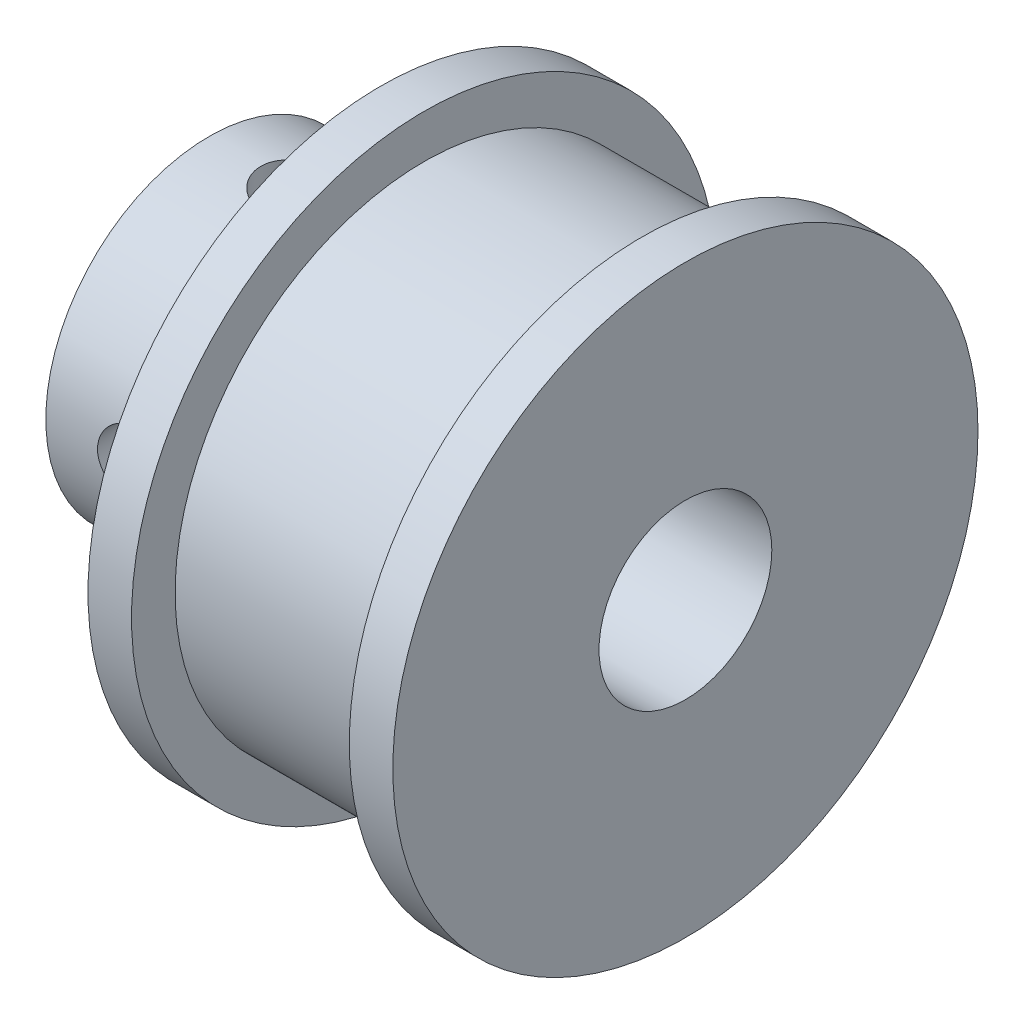
ISO-10303-21;
HEADER;
FILE_DESCRIPTION(('STEP AP214'),'2;1');
FILE_NAME('part.step','',(''),(''),'','','');
FILE_SCHEMA(('AUTOMOTIVE_DESIGN { 1 0 10303 214 1 1 1 1 }'));
ENDSEC;
DATA;
#1=APPLICATION_CONTEXT('core data for automotive mechanical design processes');
#2=APPLICATION_PROTOCOL_DEFINITION('international standard','automotive_design',2000,#1);
#3=PRODUCT_CONTEXT('',#1,'mechanical');
#4=PRODUCT('Part','Part','',(#3));
#5=PRODUCT_RELATED_PRODUCT_CATEGORY('part','',(#4));
#6=PRODUCT_DEFINITION_FORMATION('','',#4);
#7=PRODUCT_DEFINITION_CONTEXT('part definition',#1,'design');
#8=PRODUCT_DEFINITION('design','',#6,#7);
#9=PRODUCT_DEFINITION_SHAPE('','',#8);
#10=(LENGTH_UNIT() NAMED_UNIT(*) SI_UNIT(.MILLI.,.METRE.));
#11=(NAMED_UNIT(*) PLANE_ANGLE_UNIT() SI_UNIT($,.RADIAN.));
#12=(NAMED_UNIT(*) SI_UNIT($,.STERADIAN.) SOLID_ANGLE_UNIT());
#13=UNCERTAINTY_MEASURE_WITH_UNIT(LENGTH_MEASURE(1.E-05),#10,'distance_accuracy_value','');
#14=(GEOMETRIC_REPRESENTATION_CONTEXT(3) GLOBAL_UNCERTAINTY_ASSIGNED_CONTEXT((#13)) GLOBAL_UNIT_ASSIGNED_CONTEXT((#10,
#11,#12)) REPRESENTATION_CONTEXT('',''));
#15=CARTESIAN_POINT('',(0.,0.,0.));
#16=DIRECTION('',(0.,0.,1.));
#17=DIRECTION('',(1.,0.,0.));
#18=AXIS2_PLACEMENT_3D('',#15,#16,#17);
#19=CARTESIAN_POINT('',(0.,0.,0.));
#20=DIRECTION('',(1.,0.,0.));
#21=DIRECTION('',(0.,0.,-1.));
#22=AXIS2_PLACEMENT_3D('',#19,#20,#21);
#23=CYLINDRICAL_SURFACE('',#22,3.175);
#24=CARTESIAN_POINT('',(1.90000000000001,0.,3.175));
#25=CARTESIAN_POINT('',(1.9000068627745,0.0672847316330924,3.17499501338285));
#26=CARTESIAN_POINT('',(1.90546359305505,0.1346703640608,3.17283650663751));
#27=CARTESIAN_POINT('',(1.92710352845715,0.267542369031608,3.16441250521978));
#28=CARTESIAN_POINT('',(1.94331412522152,0.333023444641002,3.15813652319774));
#29=CARTESIAN_POINT('',(1.9857829777871,0.459957962416117,3.14215557601542));
#30=CARTESIAN_POINT('',(2.01200951215206,0.521423409993961,3.1324614438269));
#31=CARTESIAN_POINT('',(2.07364090841074,0.63903164640658,3.11060223187218));
#32=CARTESIAN_POINT('',(2.1090429677438,0.695176053354679,3.09843790684371));
#33=CARTESIAN_POINT('',(2.1897376821198,0.803199302091193,3.07224897424454));
#34=CARTESIAN_POINT('',(2.23538195508738,0.854801684849634,3.05816785515032));
#35=CARTESIAN_POINT('',(2.33452307874792,0.949851027050096,3.029995134943));
#36=CARTESIAN_POINT('',(2.38802352829044,0.993294227940917,3.01590353198658));
#37=CARTESIAN_POINT('',(2.5041424024409,1.07262244667806,2.98863572549245));
#38=CARTESIAN_POINT('',(2.56705314443539,1.10810421355732,2.97552454842956));
#39=CARTESIAN_POINT('',(2.698544027874,1.16785949338492,2.95258553832485));
#40=CARTESIAN_POINT('',(2.7671215628923,1.19213812572271,2.94275620617845));
#41=CARTESIAN_POINT('',(2.90482457540723,1.22768807019404,2.92809906106053));
#42=CARTESIAN_POINT('',(2.97379138336201,1.2394876533875,2.92306908743274));
#43=CARTESIAN_POINT('',(3.11289538673181,1.25139521634013,2.91799267608066));
#44=CARTESIAN_POINT('',(3.18303201481214,1.2515087076257,2.91794388907308));
#45=CARTESIAN_POINT('',(3.31747264612622,1.24044215294952,2.92266241514435));
#46=CARTESIAN_POINT('',(3.38185243388379,1.2300187638983,2.9271070555664));
#47=CARTESIAN_POINT('',(3.50786207063953,1.19943319152663,2.93977143360488));
#48=CARTESIAN_POINT('',(3.56949145415953,1.17926936651212,2.94799180758784));
#49=CARTESIAN_POINT('',(3.68970949878321,1.12939589279822,2.9674595549287));
#50=CARTESIAN_POINT('',(3.74821240698525,1.09950293840843,2.97876432051874));
#51=CARTESIAN_POINT('',(3.85958183190654,1.03114819003906,3.00311044973729));
#52=CARTESIAN_POINT('',(3.91244626347388,0.992683242204219,3.01615245182717));
#53=CARTESIAN_POINT('',(4.01519223792226,0.90489847311778,3.04369028436772));
#54=CARTESIAN_POINT('',(4.06455620057866,0.854982538626526,3.05822195069566));
#55=CARTESIAN_POINT('',(4.15437521291328,0.747422600693478,3.08627133748347));
#56=CARTESIAN_POINT('',(4.19482859712145,0.68977715576794,3.09978886808114));
#57=CARTESIAN_POINT('',(4.26632885010501,0.566964697663757,3.12460676760529));
#58=CARTESIAN_POINT('',(4.29718676961865,0.501677729871156,3.13586122258918));
#59=CARTESIAN_POINT('',(4.34730502697112,0.366284378650628,3.15453954285868));
#60=CARTESIAN_POINT('',(4.36657106552982,0.296180383098904,3.16196529078971));
#61=CARTESIAN_POINT('',(4.39192526522841,0.15748598181363,3.17180954080983));
#62=CARTESIAN_POINT('',(4.398709348115,0.08904145870925,3.174492125026));
#63=CARTESIAN_POINT('',(4.4009546291958,-0.0480536320474739,3.17537559014029));
#64=CARTESIAN_POINT('',(4.39641864995898,-0.116704144074904,3.17357758823769));
#65=CARTESIAN_POINT('',(4.3766688987383,-0.249146112043378,3.1658751934269));
#66=CARTESIAN_POINT('',(4.36192521803439,-0.313019327348947,3.16015168509209));
#67=CARTESIAN_POINT('',(4.32281288402532,-0.437330047990826,3.14535985768854));
#68=CARTESIAN_POINT('',(4.29844298886303,-0.497767108885045,3.1362911070673));
#69=CARTESIAN_POINT('',(4.23997777394203,-0.615550644692232,3.11535083253378));
#70=CARTESIAN_POINT('',(4.20560984846939,-0.672747743207499,3.10340262881889));
#71=CARTESIAN_POINT('',(4.12842792642724,-0.780761917259374,3.07800576012949));
#72=CARTESIAN_POINT('',(4.08561060602606,-0.831576469108153,3.06455650557748));
#73=CARTESIAN_POINT('',(3.98952965745297,-0.928791348114859,3.0365593899859));
#74=CARTESIAN_POINT('',(3.93577293586608,-0.974701227513619,3.02199629492691));
#75=CARTESIAN_POINT('',(3.82105274982168,-1.05696284943212,2.99421855171024));
#76=CARTESIAN_POINT('',(3.76008825217309,-1.09331321924023,2.98100409737911));
#77=CARTESIAN_POINT('',(3.63187774635261,-1.15559997165607,2.95742074651155));
#78=CARTESIAN_POINT('',(3.56458459593159,-1.18144907129597,2.9470759174758));
#79=CARTESIAN_POINT('',(3.4260725952737,-1.2212562072246,2.93080697789355));
#80=CARTESIAN_POINT('',(3.35485655568267,-1.23522264211379,2.92487974538276));
#81=CARTESIAN_POINT('',(3.21589405502895,-1.25007804085777,2.91855940228496));
#82=CARTESIAN_POINT('',(3.1482538653394,-1.25181430561831,2.91780781401761));
#83=CARTESIAN_POINT('',(3.01369577979596,-1.24437120429059,2.92098982763324));
#84=CARTESIAN_POINT('',(2.94677779981834,-1.23519312367105,2.92492287776943));
#85=CARTESIAN_POINT('',(2.81810207173594,-1.20686591196944,2.93671925445626));
#86=CARTESIAN_POINT('',(2.75624498467543,-1.18809939057282,2.9444313340829));
#87=CARTESIAN_POINT('',(2.63652982106708,-1.14148049607648,2.96281485611587));
#88=CARTESIAN_POINT('',(2.57867280512971,-1.1136257243581,2.97348707966731));
#89=CARTESIAN_POINT('',(2.4650674647447,-1.04781462002773,2.99733186522452));
#90=CARTESIAN_POINT('',(2.40961923756217,-1.00937948877753,3.01061106475901));
#91=CARTESIAN_POINT('',(2.30568987821778,-0.924206507043676,3.0378387527675));
#92=CARTESIAN_POINT('',(2.25721118976831,-0.877465757163235,3.05178747371865));
#93=CARTESIAN_POINT('',(2.16551587816836,-0.773553196077986,3.07982295515274));
#94=CARTESIAN_POINT('',(2.12281309958007,-0.715913819660185,3.09386447942524));
#95=CARTESIAN_POINT('',(2.04769454049986,-0.5937664037964,3.11960779538581));
#96=CARTESIAN_POINT('',(2.01528012935281,-0.529257451559142,3.13130927554577));
#97=CARTESIAN_POINT('',(1.96417540099936,-0.400855491445671,3.15020502613284));
#98=CARTESIAN_POINT('',(1.94455266817755,-0.337376283301317,3.15769788512325));
#99=CARTESIAN_POINT('',(1.91563614784328,-0.207895662632507,3.16884766902594));
#100=CARTESIAN_POINT('',(1.90631397142025,-0.141901703524203,3.17251513536217));
#101=CARTESIAN_POINT('',(1.90076135384054,-0.0504531001608372,3.17470085654944));
#102=CARTESIAN_POINT('',(1.8999974262687,-0.0252336457199433,3.17500187012012));
#103=CARTESIAN_POINT('',(1.90000000000001,0.,3.175));
#104=B_SPLINE_CURVE_WITH_KNOTS('',3,(#24,#25,#26,#27,#28,#29,#30,#31,#32,#33,#34,#35,#36,#37,
#38,#39,#40,#41,#42,#43,#44,#45,#46,#47,#48,#49,#50,#51,#52,#53,#54,#55,#56,#57,#58,#59,#60,#61,
#62,#63,#64,#65,#66,#67,#68,#69,#70,#71,#72,#73,#74,#75,#76,#77,#78,#79,#80,#81,#82,#83,#84,#85,
#86,#87,#88,#89,#90,#91,#92,#93,#94,#95,#96,#97,#98,#99,#100,#101,#102,#103),.UNSPECIFIED.,.T.,
.F.,(4,2,2,2,2,2,2,2,2,2,2,2,2,2,2,2,2,2,2,2,2,2,2,2,2,2,2,2,2,2,2,2,2,2,2,2,2,2,2,4),(0.,
0.201779437744548,0.404074820308127,0.605734757050763,0.807333171478417,1.01735976436243,
1.2274828705813,1.44660259463333,1.66562209023744,1.87494520835713,2.08416960269575,
2.27936669865592,2.47459670544107,2.67374147234743,2.87295963102294,3.08705517744558,
3.30119070642572,3.51930901537433,3.73731996902137,3.94275765182502,4.14814411546712,
4.34465147529728,4.54118419440118,4.7436789821994,4.94625358697288,5.1617892735487,
5.37735589340512,5.59467927329235,5.81184892233299,6.01381057507249,6.21574844354767,
6.41019345194811,6.60468982086286,6.81009090996547,7.01556384361703,7.2337987698656,
7.45206273023339,7.65177261299093,7.85093070050895,7.92660360165657),.UNSPECIFIED.);
#105=CARTESIAN_POINT('',(1.90000000000001,0.,3.175));
#106=VERTEX_POINT('',#105);
#107=EDGE_CURVE('E624',#106,#106,#104,.T.);
#108=ORIENTED_EDGE('',*,*,#107,.F.);
#109=EDGE_LOOP('',(#108));
#110=FACE_BOUND('',#109,.T.);
#111=CARTESIAN_POINT('',(3.15,2.91858270398493,-1.25));
#112=CARTESIAN_POINT('',(3.21705876770274,2.91858919552523,-1.24999286391997));
#113=CARTESIAN_POINT('',(3.28421776991305,2.92092645038722,-1.24457161253238));
#114=CARTESIAN_POINT('',(3.41661509708975,2.92998517442319,-1.2230858011541));
#115=CARTESIAN_POINT('',(3.48184795863823,2.93671805691524,-1.20699353198018));
#116=CARTESIAN_POINT('',(3.60825570633315,2.95367783504784,-1.16486992778129));
#117=CARTESIAN_POINT('',(3.66944461339327,2.96389181028401,-1.13887530486567));
#118=CARTESIAN_POINT('',(3.78657755098346,2.98664490940932,-1.07779173231123));
#119=CARTESIAN_POINT('',(3.84252284402701,2.99918347142755,-1.04270497949831));
#120=CARTESIAN_POINT('',(3.95071189018399,3.02595080926506,-0.962353829492942));
#121=CARTESIAN_POINT('',(4.00262881457917,3.04023283739072,-0.916666915264533));
#122=CARTESIAN_POINT('',(4.09830169841413,3.06843728874988,-0.817302314146456));
#123=CARTESIAN_POINT('',(4.1420548518516,3.08235958692784,-0.763621891133198));
#124=CARTESIAN_POINT('',(4.22176349783716,3.10891201177461,-0.64728579706301));
#125=CARTESIAN_POINT('',(4.25735944266869,3.12147292007291,-0.584366556004033));
#126=CARTESIAN_POINT('',(4.31732314068053,3.14324422109986,-0.452850465301555));
#127=CARTESIAN_POINT('',(4.34169532800117,3.15245593668199,-0.384255870461471));
#128=CARTESIAN_POINT('',(4.37736018254707,3.16611423056324,-0.2467608971739));
#129=CARTESIAN_POINT('',(4.38921442617454,3.17076466636064,-0.178026840226493));
#130=CARTESIAN_POINT('',(4.40131288966092,3.17551190440968,-0.0393983009347702));
#131=CARTESIAN_POINT('',(4.40156129942229,3.17561035000669,0.0304957535146294));
#132=CARTESIAN_POINT('',(4.39075388885007,3.17136802875332,0.165409649899385));
#133=CARTESIAN_POINT('',(4.380312782763,3.16726865978232,0.230487686315578));
#134=CARTESIAN_POINT('',(4.34946532592636,3.15541444614498,0.357881536818985));
#135=CARTESIAN_POINT('',(4.32905824593686,3.14765933397851,0.420197148407344));
#136=CARTESIAN_POINT('',(4.27860558354179,3.12910832817148,0.541410179653869));
#137=CARTESIAN_POINT('',(4.24842031728481,3.11826866169305,0.600242482304685));
#138=CARTESIAN_POINT('',(4.17939703639771,3.09462975143761,0.712157346885298));
#139=CARTESIAN_POINT('',(4.1405560971742,3.08182984578998,0.765237956392509));
#140=CARTESIAN_POINT('',(4.05243182003348,3.05461022779038,0.867739124124568));
#141=CARTESIAN_POINT('',(4.00264013608172,3.04013927358102,0.916709689716655));
#142=CARTESIAN_POINT('',(3.89548656480707,3.01184461230875,1.00578635680649));
#143=CARTESIAN_POINT('',(3.83812236311636,2.99802110488019,1.04588973818711));
#144=CARTESIAN_POINT('',(3.71550154425415,2.9722444532213,1.11707822475766));
#145=CARTESIAN_POINT('',(3.6500754582507,2.96035090580402,1.14789479354929));
#146=CARTESIAN_POINT('',(3.5143696785953,2.94047661183176,1.19789603572418));
#147=CARTESIAN_POINT('',(3.44409305117512,2.93249341875955,1.21708798384633));
#148=CARTESIAN_POINT('',(3.30516034266536,2.92193314346724,1.24221885837745));
#149=CARTESIAN_POINT('',(3.2366574611002,2.9190621155793,1.24887973581001));
#150=CARTESIAN_POINT('',(3.09946758767574,2.91821507641654,1.25085924710212));
#151=CARTESIAN_POINT('',(3.03078065469026,2.92023765193577,1.24618115550066));
#152=CARTESIAN_POINT('',(2.89910081239854,2.92864903711891,1.22627220656949));
#153=CARTESIAN_POINT('',(2.83600149325999,2.93479414330475,1.21162973372095));
#154=CARTESIAN_POINT('',(2.71319369775327,2.95045928061593,1.17296502005911));
#155=CARTESIAN_POINT('',(2.65348596177989,2.95998004539956,1.14894074010909));
#156=CARTESIAN_POINT('',(2.53650689226705,2.98178824537218,1.09112415058302));
#157=CARTESIAN_POINT('',(2.47942723563771,2.99417074871089,1.05698098829747));
#158=CARTESIAN_POINT('',(2.37155358654007,3.02015852173764,0.980258179031947));
#159=CARTESIAN_POINT('',(2.32076210314278,3.03376427580628,0.937675181950988));
#160=CARTESIAN_POINT('',(2.22315311375844,3.06183438952279,0.841703377564378));
#161=CARTESIAN_POINT('',(2.17687527629868,3.07629098175068,0.787761391689884));
#162=CARTESIAN_POINT('',(2.09394958907587,3.1035190255834,0.672529083864432));
#163=CARTESIAN_POINT('',(2.05730202921282,3.1162904264532,0.611238540780897));
#164=CARTESIAN_POINT('',(1.99484313276734,3.13873566281396,0.482904338615098));
#165=CARTESIAN_POINT('',(1.96901930828488,3.14841306493411,0.415867417631866));
#166=CARTESIAN_POINT('',(1.92917965457089,3.16357142711523,0.277927786036162));
#167=CARTESIAN_POINT('',(1.91515764017672,3.16905458518296,0.207027121129187));
#168=CARTESIAN_POINT('',(1.90003726977397,3.17497850608976,0.0682260342168539));
#169=CARTESIAN_POINT('',(1.89817498964644,3.17571727826717,0.000420884757595325));
#170=CARTESIAN_POINT('',(1.90542306137319,3.1728670277863,-0.134500374630681));
#171=CARTESIAN_POINT('',(1.9145318409792,3.16927862524971,-0.201616581901098));
#172=CARTESIAN_POINT('',(1.94291936225415,3.15832315585951,-0.331261459507754));
#173=CARTESIAN_POINT('',(1.96189513645233,3.15106882901496,-0.393866748155006));
#174=CARTESIAN_POINT('',(2.00916415022582,3.13355246801338,-0.514998013360591));
#175=CARTESIAN_POINT('',(2.03745913359075,3.12328987099511,-0.573523223978585));
#176=CARTESIAN_POINT('',(2.10396081746341,3.10021124636329,-0.687642991756168));
#177=CARTESIAN_POINT('',(2.14254680575914,3.08730319204293,-0.742997519181306));
#178=CARTESIAN_POINT('',(2.22796048608835,3.0604965861267,-0.846674739986252));
#179=CARTESIAN_POINT('',(2.27479143506869,3.04659764440369,-0.894994640697079));
#180=CARTESIAN_POINT('',(2.3786645370051,3.01835076024438,-0.986204093974814));
#181=CARTESIAN_POINT('',(2.43614870477354,3.00402537078839,-1.02859889387657));
#182=CARTESIAN_POINT('',(2.55787929604743,2.97745127531598,-1.10316965268165));
#183=CARTESIAN_POINT('',(2.62212660256846,2.96520284101944,-1.13534427499941));
#184=CARTESIAN_POINT('',(2.74980593068555,2.94527735121899,-1.18601952811124));
#185=CARTESIAN_POINT('',(2.81281216952646,2.93729286701932,-1.20547430735444));
#186=CARTESIAN_POINT('',(2.94135798876503,2.92533709276108,-1.23421212719399));
#187=CARTESIAN_POINT('',(3.00688989438575,2.92135450819833,-1.24352380081826));
#188=CARTESIAN_POINT('',(3.09843968257498,2.91892238480656,-1.24920484852849));
#189=CARTESIAN_POINT('',(3.12421242994352,2.91858020765141,-1.25000274419244));
#190=CARTESIAN_POINT('',(3.15,2.91858270398493,-1.25));
#191=B_SPLINE_CURVE_WITH_KNOTS('',3,(#111,#112,#113,#114,#115,#116,#117,#118,#119,#120,#121,
#122,#123,#124,#125,#126,#127,#128,#129,#130,#131,#132,#133,#134,#135,#136,#137,#138,#139,#140,
#141,#142,#143,#144,#145,#146,#147,#148,#149,#150,#151,#152,#153,#154,#155,#156,#157,#158,#159,
#160,#161,#162,#163,#164,#165,#166,#167,#168,#169,#170,#171,#172,#173,#174,#175,#176,#177,#178,
#179,#180,#181,#182,#183,#184,#185,#186,#187,#188,#189,#190),.UNSPECIFIED.,.T.,.F.,(4,2,2,2,2,2,
2,2,2,2,2,2,2,2,2,2,2,2,2,2,2,2,2,2,2,2,2,2,2,2,2,2,2,2,2,2,2,2,2,4),(0.,0.20109806062216,
0.402720363484106,0.603602331741175,0.804435808400704,1.01535170829682,1.22633996993093,
1.44534686764129,1.66426716849029,1.87288447318198,2.08142646291369,2.27861453584364,
2.47581703977309,2.67597098178837,2.87619265497002,3.08919652800103,3.30226565219754,
3.52100766319138,3.73961264265535,3.94518390476032,4.1506958077731,4.34501913391243,
4.5393847197749,4.74148953365143,4.94367473209367,5.16024174600764,5.37681527848653,
5.59313824650931,5.80934777198827,6.01183163883026,6.21428649142563,6.41086299855999,
6.60747630956881,6.81268639074811,7.01797771720266,7.23549456942807,7.45303985660975,
7.65144122721413,7.84928106635439,7.92661368823473),.UNSPECIFIED.);
#192=CARTESIAN_POINT('',(3.15,2.91858270398493,-1.25));
#193=VERTEX_POINT('',#192);
#194=EDGE_CURVE('E639',#193,#193,#191,.T.);
#195=ORIENTED_EDGE('',*,*,#194,.F.);
#196=EDGE_LOOP('',(#195));
#197=FACE_BOUND('',#196,.T.);
#198=CARTESIAN_POINT('',(17.5,0.,0.));
#199=DIRECTION('',(1.,0.,0.));
#200=DIRECTION('',(0.,0.,-1.));
#201=AXIS2_PLACEMENT_3D('',#198,#199,#200);
#202=CIRCLE('',#201,3.175);
#203=CARTESIAN_POINT('',(17.5,0.,-3.175));
#204=VERTEX_POINT('',#203);
#205=EDGE_CURVE('E663',#204,#204,#202,.T.);
#206=ORIENTED_EDGE('',*,*,#205,.T.);
#207=EDGE_LOOP('',(#206));
#208=FACE_BOUND('',#207,.T.);
#209=CARTESIAN_POINT('',(0.,0.,0.));
#210=DIRECTION('',(1.,0.,0.));
#211=DIRECTION('',(0.,0.,-1.));
#212=AXIS2_PLACEMENT_3D('',#209,#210,#211);
#213=CIRCLE('',#212,3.175);
#214=CARTESIAN_POINT('',(0.,0.,-3.175));
#215=VERTEX_POINT('',#214);
#216=EDGE_CURVE('E12',#215,#215,#213,.T.);
#217=ORIENTED_EDGE('',*,*,#216,.F.);
#218=EDGE_LOOP('',(#217));
#219=FACE_BOUND('',#218,.T.);
#220=ADVANCED_FACE('F620',(#110,#197,#208,#219),#23,.F.);
#221=CARTESIAN_POINT('',(0.,3.175,0.));
#222=DIRECTION('',(-1.,0.,0.));
#223=DIRECTION('',(0.,0.,1.));
#224=AXIS2_PLACEMENT_3D('',#221,#222,#223);
#225=PLANE('',#224);
#226=ORIENTED_EDGE('',*,*,#216,.T.);
#227=EDGE_LOOP('',(#226));
#228=FACE_BOUND('',#227,.T.);
#229=CARTESIAN_POINT('',(0.,0.,0.));
#230=DIRECTION('',(1.,0.,0.));
#231=DIRECTION('',(0.,0.,-1.));
#232=AXIS2_PLACEMENT_3D('',#229,#230,#231);
#233=CIRCLE('',#232,6.);
#234=CARTESIAN_POINT('',(0.,0.,-6.));
#235=VERTEX_POINT('',#234);
#236=EDGE_CURVE('E631',#235,#235,#233,.T.);
#237=ORIENTED_EDGE('',*,*,#236,.F.);
#238=EDGE_LOOP('',(#237));
#239=FACE_BOUND('',#238,.T.);
#240=ADVANCED_FACE('F672',(#228,#239),#225,.T.);
#241=CARTESIAN_POINT('',(0.,0.,0.));
#242=DIRECTION('',(1.,0.,0.));
#243=DIRECTION('',(0.,0.,-1.));
#244=AXIS2_PLACEMENT_3D('',#241,#242,#243);
#245=CYLINDRICAL_SURFACE('',#244,6.);
#246=CARTESIAN_POINT('',(1.90000000000001,0.,6.));
#247=CARTESIAN_POINT('',(1.90000247746923,-0.0694090417016603,5.99999871526651));
#248=CARTESIAN_POINT('',(1.90580066571876,-0.138848789520875,5.99878328775043));
#249=CARTESIAN_POINT('',(1.92881934953286,-0.275761316266992,5.99405200990679));
#250=CARTESIAN_POINT('',(1.94604852303694,-0.343232560128311,5.99053441189248));
#251=CARTESIAN_POINT('',(1.99137045492183,-0.474209132291339,5.98159109196202));
#252=CARTESIAN_POINT('',(2.01945239599889,-0.537718336709182,5.97616727052645));
#253=CARTESIAN_POINT('',(2.08564960885619,-0.659120328605954,5.96399927809859));
#254=CARTESIAN_POINT('',(2.12376443115584,-0.717013367534323,5.95725516625975));
#255=CARTESIAN_POINT('',(2.20953634019065,-0.826390324308832,5.9430770002465));
#256=CARTESIAN_POINT('',(2.25731200123509,-0.87778024416268,5.93563505848531));
#257=CARTESIAN_POINT('',(2.36079465919511,-0.971877776769387,5.92095657692448));
#258=CARTESIAN_POINT('',(2.41650231187227,-1.01458467096098,5.91372005416683));
#259=CARTESIAN_POINT('',(2.53495196876616,-1.09051031677216,5.90019442595308));
#260=CARTESIAN_POINT('',(2.59775838450275,-1.1236305468065,5.89391545174828));
#261=CARTESIAN_POINT('',(2.72819745177276,-1.17881119348063,5.8831284065002));
#262=CARTESIAN_POINT('',(2.79582958244254,-1.20087280167641,5.87862014467568));
#263=CARTESIAN_POINT('',(2.93298523741564,-1.23300240133736,5.87196500986123));
#264=CARTESIAN_POINT('',(3.00246835933477,-1.24323597696798,5.86978556855865));
#265=CARTESIAN_POINT('',(3.14219684286263,-1.25193357655614,5.86793690716491));
#266=CARTESIAN_POINT('',(3.2124421188653,-1.25039890894686,5.86826740800981));
#267=CARTESIAN_POINT('',(3.35048102797518,-1.23573719037196,5.87137174319175));
#268=CARTESIAN_POINT('',(3.41829597966121,-1.2228010523272,5.87410533679901));
#269=CARTESIAN_POINT('',(3.55077150964493,-1.18600543529945,5.88164437615942));
#270=CARTESIAN_POINT('',(3.61543192560633,-1.16214539481381,5.88644992841317));
#271=CARTESIAN_POINT('',(3.74030722841598,-1.10400003213928,5.89763191464102));
#272=CARTESIAN_POINT('',(3.80048629652707,-1.06964002534236,5.90401953785586));
#273=CARTESIAN_POINT('',(3.91429574426816,-0.991522699274812,5.91763890010721));
#274=CARTESIAN_POINT('',(3.96792530883597,-0.947764212262582,5.92487074398537));
#275=CARTESIAN_POINT('',(4.06821396108037,-0.851074921546777,5.93953730929909));
#276=CARTESIAN_POINT('',(4.11471616889701,-0.797981433412077,5.94697323199473));
#277=CARTESIAN_POINT('',(4.19818044222897,-0.684667288611794,5.96108088143001));
#278=CARTESIAN_POINT('',(4.23514236459839,-0.624446525025762,5.96775259670236));
#279=CARTESIAN_POINT('',(4.29851008153595,-0.498405541235475,5.97959870942815));
#280=CARTESIAN_POINT('',(4.32489680456711,-0.432575461926497,5.98477039710258));
#281=CARTESIAN_POINT('',(4.36619170483549,-0.297284620972153,5.99301338211281));
#282=CARTESIAN_POINT('',(4.38110139323139,-0.227824338595088,5.99608495596053));
#283=CARTESIAN_POINT('',(4.39879425206788,-0.0885918657008349,5.99974275215455));
#284=CARTESIAN_POINT('',(4.40179194149424,-0.0188480555261788,6.00037293537579));
#285=CARTESIAN_POINT('',(4.39615505003089,0.120143798757714,5.99919952252774));
#286=CARTESIAN_POINT('',(4.3875211813984,0.189391872962257,5.99739607548153));
#287=CARTESIAN_POINT('',(4.35904434653046,0.324726367119811,5.99158564979184));
#288=CARTESIAN_POINT('',(4.33931251461653,0.390837192894204,5.98760052868077));
#289=CARTESIAN_POINT('',(4.28932213957859,0.518811446661328,5.97787227242395));
#290=CARTESIAN_POINT('',(4.25906275913401,0.580674536336772,5.97212899744579));
#291=CARTESIAN_POINT('',(4.18841962176244,0.69929430694349,5.95941241490714));
#292=CARTESIAN_POINT('',(4.14790807043093,0.755973219469829,5.9524239381233));
#293=CARTESIAN_POINT('',(4.05808043692373,0.861805445886515,5.93802568299709));
#294=CARTESIAN_POINT('',(4.00876332448106,0.910957877913281,5.93061585542511));
#295=CARTESIAN_POINT('',(3.9017444230003,1.0011786486518,5.91606024531377));
#296=CARTESIAN_POINT('',(3.84391696804472,1.04209914600204,5.90892089307501));
#297=CARTESIAN_POINT('',(3.72208371578621,1.11364719079243,5.89585601015805));
#298=CARTESIAN_POINT('',(3.65807817586089,1.14427516677863,5.88993042894651));
#299=CARTESIAN_POINT('',(3.52603880370177,1.19417246443921,5.88001700708041));
#300=CARTESIAN_POINT('',(3.45802896283416,1.21350309828031,5.87601872784687));
#301=CARTESIAN_POINT('',(3.31963344950774,1.24044038523407,5.87039184709697));
#302=CARTESIAN_POINT('',(3.24924811838056,1.2480487154444,5.86876290660367));
#303=CARTESIAN_POINT('',(3.10958659900035,1.25125926487611,5.86807907308506));
#304=CARTESIAN_POINT('',(3.04031592977795,1.24709542622725,5.86897402321502));
#305=CARTESIAN_POINT('',(2.90348599107978,1.22739905314031,5.87312447254928));
#306=CARTESIAN_POINT('',(2.8359267051839,1.21186662782265,5.87637994909626));
#307=CARTESIAN_POINT('',(2.70460222810934,1.16998217768584,5.88486132447716));
#308=CARTESIAN_POINT('',(2.64082675351308,1.14366117568421,5.8900815700793));
#309=CARTESIAN_POINT('',(2.51856122397334,1.08097457299757,5.90190705738738));
#310=CARTESIAN_POINT('',(2.46007166036688,1.04460803983029,5.9085124276546));
#311=CARTESIAN_POINT('',(2.34887837292056,0.962073695342405,5.92251579551146));
#312=CARTESIAN_POINT('',(2.29630087543502,0.91573789041822,5.92992613868404));
#313=CARTESIAN_POINT('',(2.19959050677365,0.814924438115329,5.94461839583213));
#314=CARTESIAN_POINT('',(2.15545958244852,0.760444918832963,5.9519002798488));
#315=CARTESIAN_POINT('',(2.07641142681595,0.644134427507699,5.96561444547637));
#316=CARTESIAN_POINT('',(2.04160632011372,0.582225921521345,5.97203596073244));
#317=CARTESIAN_POINT('',(1.98294977156998,0.453319843998451,5.98319908494092));
#318=CARTESIAN_POINT('',(1.95908875281813,0.386326781907242,5.98794216182101));
#319=CARTESIAN_POINT('',(1.92745972171158,0.266015292900104,5.99432499781443));
#320=CARTESIAN_POINT('',(1.91718123679115,0.213367593727928,5.99644035661395));
#321=CARTESIAN_POINT('',(1.90345054572268,0.107152674176536,5.99927832789758));
#322=CARTESIAN_POINT('',(1.89999808733282,0.0535854878488715,6.00000099184586));
#323=CARTESIAN_POINT('',(1.90000000000001,0.,6.));
#324=B_SPLINE_CURVE_WITH_KNOTS('',3,(#246,#247,#248,#249,#250,#251,#252,#253,#254,#255,#256,
#257,#258,#259,#260,#261,#262,#263,#264,#265,#266,#267,#268,#269,#270,#271,#272,#273,#274,#275,
#276,#277,#278,#279,#280,#281,#282,#283,#284,#285,#286,#287,#288,#289,#290,#291,#292,#293,#294,
#295,#296,#297,#298,#299,#300,#301,#302,#303,#304,#305,#306,#307,#308,#309,#310,#311,#312,#313,
#314,#315,#316,#317,#318,#319,#320,#321,#322,#323),.UNSPECIFIED.,.T.,.F.,(4,2,2,2,2,2,2,2,2,2,2,
2,2,2,2,2,2,2,2,2,2,2,2,2,2,2,2,2,2,2,2,2,2,2,2,2,2,2,4),(0.,0.208031045103182,
0.416220199906223,0.624202378825439,0.832175241572985,1.04287526388122,1.25359271551785,
1.46640449178548,1.67919333285489,1.88896575169853,2.09871484767163,2.30501712129058,
2.51133000030278,2.71914592416748,2.92698768368033,3.13889526355464,3.35080602278216,
3.5630972449966,3.77536051045769,3.98378339407673,4.19219351552275,4.39855286632619,
4.60492863390931,4.81401583995734,5.02312752564571,5.23571263829333,5.44828889851306,
5.65970050095022,5.87108185414182,6.07829223291035,6.28550062281358,6.49211731393252,
6.69875319081476,6.90919024830305,7.11967575117366,7.33258864398252,7.54531486464969,
7.70592588477276,7.86653096973387),.UNSPECIFIED.);
#325=CARTESIAN_POINT('',(1.90000000000001,0.,6.));
#326=VERTEX_POINT('',#325);
#327=EDGE_CURVE('E645',#326,#326,#324,.T.);
#328=ORIENTED_EDGE('',*,*,#327,.F.);
#329=EDGE_LOOP('',(#328));
#330=FACE_BOUND('',#329,.T.);
#331=CARTESIAN_POINT('',(3.15,5.86834729715275,-1.25));
#332=CARTESIAN_POINT('',(3.08060938484897,5.86834869213645,-1.24999750877599));
#333=CARTESIAN_POINT('',(3.01118802798478,5.86959145924544,-1.24420229433948));
#334=CARTESIAN_POINT('',(2.87431368268275,5.87442015581798,-1.22119649233779));
#335=CARTESIAN_POINT('',(2.80686224449358,5.87800788138388,-1.20397715440342));
#336=CARTESIAN_POINT('',(2.67592762716513,5.8871029296193,-1.1586839750723));
#337=CARTESIAN_POINT('',(2.6124404040082,5.89260825706945,-1.13062141248932));
#338=CARTESIAN_POINT('',(2.4910755003544,5.90491581335741,-1.06446988601732));
#339=CARTESIAN_POINT('',(2.43319759326998,5.91171798977622,-1.0263813273582));
#340=CARTESIAN_POINT('',(2.32380462484654,5.92596934661468,-0.940636399466082));
#341=CARTESIAN_POINT('',(2.27238810637353,5.93342614373039,-0.892855554869668));
#342=CARTESIAN_POINT('',(2.1782389313519,5.94807966802575,-0.789351223880636));
#343=CARTESIAN_POINT('',(2.13550691170856,5.95527637609915,-0.733627155456002));
#344=CARTESIAN_POINT('',(2.05955411191714,5.96868135118848,-0.615162052999588));
#345=CARTESIAN_POINT('',(2.02642747353674,5.97487958631242,-0.552359428204941));
#346=CARTESIAN_POINT('',(1.97123394714022,5.98550347343302,-0.421928551006719));
#347=CARTESIAN_POINT('',(1.94916593484647,5.98992930561222,-0.354300789950591));
#348=CARTESIAN_POINT('',(1.91702423888253,5.99645589892179,-0.217162904200502));
#349=CARTESIAN_POINT('',(1.90678398280484,5.99858891959926,-0.147693380916357));
#350=CARTESIAN_POINT('',(1.89806830424298,6.00040112580612,-0.00799184883952432));
#351=CARTESIAN_POINT('',(1.8995916558069,6.0000805670369,0.0622400797368385));
#352=CARTESIAN_POINT('',(1.91423460095674,5.99704658090511,0.200326586199572));
#353=CARTESIAN_POINT('',(1.92717471895812,5.99437018956584,0.268201128726475));
#354=CARTESIAN_POINT('',(1.96399862533131,5.98696720898885,0.400793746289752));
#355=CARTESIAN_POINT('',(1.98788287720308,5.98224053291904,0.465511687511022));
#356=CARTESIAN_POINT('',(2.0460800521255,5.97120767323924,0.590460005384683));
#357=CARTESIAN_POINT('',(2.08046229420966,5.96489104125346,0.65065713498165));
#358=CARTESIAN_POINT('',(2.15862800284042,5.95137300440189,0.764493456510647));
#359=CARTESIAN_POINT('',(2.20241263820613,5.94417148958325,0.818131831816418));
#360=CARTESIAN_POINT('',(2.29912162489106,5.92951700233276,0.918394203276912));
#361=CARTESIAN_POINT('',(2.35220305998195,5.92206184975925,0.964866487494794));
#362=CARTESIAN_POINT('',(2.4654820489948,5.90786872648996,1.04827597240488));
#363=CARTESIAN_POINT('',(2.52567976138724,5.9011307717716,1.0852129606998));
#364=CARTESIAN_POINT('',(2.6517122548288,5.88912998409156,1.14856217138454));
#365=CARTESIAN_POINT('',(2.71756065069343,5.88387085232125,1.17494805489727));
#366=CARTESIAN_POINT('',(2.85289161936939,5.8754760641036,1.21623577538673));
#367=CARTESIAN_POINT('',(2.92237367280809,5.87234010507182,1.23113924882349));
#368=CARTESIAN_POINT('',(3.06161970631891,5.86860783239132,1.24880863867017));
#369=CARTESIAN_POINT('',(3.13135458453703,5.86796551863474,1.25179442917998));
#370=CARTESIAN_POINT('',(3.27032581154014,5.86916952018704,1.24613693439294));
#371=CARTESIAN_POINT('',(3.33956219090234,5.87101568152623,1.23749436857863));
#372=CARTESIAN_POINT('',(3.47482051605812,5.87694538226166,1.20901558325484));
#373=CARTESIAN_POINT('',(3.54086866717883,5.88100511282998,1.18929841376871));
#374=CARTESIAN_POINT('',(3.6687239894416,5.8908833850312,1.13935810860919));
#375=CARTESIAN_POINT('',(3.7305307856504,5.89670208191057,1.10913404556146));
#376=CARTESIAN_POINT('',(3.84910644121623,5.90954501937191,1.03854598181485));
#377=CARTESIAN_POINT('',(3.90579220446617,5.91658506648323,0.998045327353962));
#378=CARTESIAN_POINT('',(4.01164324915506,5.93103483993908,0.908234440569878));
#379=CARTESIAN_POINT('',(4.06080768623923,5.93844460766532,0.858923220505172));
#380=CARTESIAN_POINT('',(4.15106271309716,5.95294924316736,0.751900450843339));
#381=CARTESIAN_POINT('',(4.19200409502638,5.9600367471991,0.694061907614551));
#382=CARTESIAN_POINT('',(4.26358875208798,5.97296708772407,0.57220010221636));
#383=CARTESIAN_POINT('',(4.29423248223745,5.97880997920818,0.508177113476881));
#384=CARTESIAN_POINT('',(4.34413867931735,5.98856148270679,0.376142117847919));
#385=CARTESIAN_POINT('',(4.36346916554434,5.99248163136497,0.308156710970195));
#386=CARTESIAN_POINT('',(4.3904144040081,5.99799561410226,0.169813400503473));
#387=CARTESIAN_POINT('',(4.39803069353274,5.99958975342889,0.0994558094616958));
#388=CARTESIAN_POINT('',(4.40126762204851,6.00026408056941,-0.0402133434703387));
#389=CARTESIAN_POINT('',(4.39711189999473,5.99939113754811,-0.109519592177922));
#390=CARTESIAN_POINT('',(4.37741936134707,5.99532874094472,-0.246422870373552));
#391=CARTESIAN_POINT('',(4.36188271359323,5.99213932172839,-0.314019925202702));
#392=CARTESIAN_POINT('',(4.31997220535144,5.98380460077544,-0.445431965492052));
#393=CARTESIAN_POINT('',(4.29362733614689,5.97866453407556,-0.509256550004524));
#394=CARTESIAN_POINT('',(4.230877602268,5.96697995347704,-0.631610567220741));
#395=CARTESIAN_POINT('',(4.19447186165686,5.96043531730246,-0.690139538279511));
#396=CARTESIAN_POINT('',(4.11189033200669,5.94651596786386,-0.80134032129826));
#397=CARTESIAN_POINT('',(4.0655557119433,5.93912880302851,-0.853892633615926));
#398=CARTESIAN_POINT('',(3.96475549900292,5.9244278681135,-0.950552741980385));
#399=CARTESIAN_POINT('',(3.91028797005157,5.91711411595368,-0.994658521571232));
#400=CARTESIAN_POINT('',(3.79399089756656,5.90329191643327,-1.07367451852767));
#401=CARTESIAN_POINT('',(3.73208158853791,5.89679406702551,-1.10846928126994));
#402=CARTESIAN_POINT('',(3.60317484391674,5.88547039658063,-1.16710627925306));
#403=CARTESIAN_POINT('',(3.53618195154699,5.88064310352601,-1.1909581629246));
#404=CARTESIAN_POINT('',(3.41589371843157,5.87414004405196,-1.22256554131861));
#405=CARTESIAN_POINT('',(3.36327046340695,5.87198163591589,-1.2328344900567));
#406=CARTESIAN_POINT('',(3.25710421947899,5.86908475266778,-1.24655254358404));
#407=CARTESIAN_POINT('',(3.20356126768996,5.86834622039193,-1.25000192292741));
#408=CARTESIAN_POINT('',(3.15,5.86834729715275,-1.25));
#409=B_SPLINE_CURVE_WITH_KNOTS('',3,(#331,#332,#333,#334,#335,#336,#337,#338,#339,#340,#341,
#342,#343,#344,#345,#346,#347,#348,#349,#350,#351,#352,#353,#354,#355,#356,#357,#358,#359,#360,
#361,#362,#363,#364,#365,#366,#367,#368,#369,#370,#371,#372,#373,#374,#375,#376,#377,#378,#379,
#380,#381,#382,#383,#384,#385,#386,#387,#388,#389,#390,#391,#392,#393,#394,#395,#396,#397,#398,
#399,#400,#401,#402,#403,#404,#405,#406,#407,#408),.UNSPECIFIED.,.T.,.F.,(4,2,2,2,2,2,2,2,2,2,2,
2,2,2,2,2,2,2,2,2,2,2,2,2,2,2,2,2,2,2,2,2,2,2,2,2,2,2,4),(0.,0.207975654071269,0.41611079241747,
0.624030014802729,0.831940834815791,1.04271333467885,1.25350128663874,1.46629026266844,
1.67905760106933,1.88879048859264,2.09850151896339,2.30497341416461,2.5114540545587,
2.71932871977949,2.9272292410426,3.13905862244913,3.35089272191628,3.56325237332487,
3.77558175387597,3.98397516009792,4.19235567296524,4.39853786231922,4.60473825464031,
4.81383917934651,5.02296356082185,5.23559458753343,5.4482162175904,5.65954599648534,
5.87084803959581,6.07816293922644,6.28547476332981,6.492234105851,6.69901145528173,
6.90938318978573,7.11980508427535,7.33272651358123,7.54545984571988,7.70599867585769,
7.8665310426116),.UNSPECIFIED.);
#410=CARTESIAN_POINT('',(3.15,5.86834729715275,-1.25));
#411=VERTEX_POINT('',#410);
#412=EDGE_CURVE('E644',#411,#411,#409,.T.);
#413=ORIENTED_EDGE('',*,*,#412,.F.);
#414=EDGE_LOOP('',(#413));
#415=FACE_BOUND('',#414,.T.);
#416=ORIENTED_EDGE('',*,*,#236,.T.);
#417=EDGE_LOOP('',(#416));
#418=FACE_BOUND('',#417,.T.);
#419=CARTESIAN_POINT('',(6.3,0.,0.));
#420=DIRECTION('',(1.,0.,0.));
#421=DIRECTION('',(0.,0.,-1.));
#422=AXIS2_PLACEMENT_3D('',#419,#420,#421);
#423=CIRCLE('',#422,6.);
#424=CARTESIAN_POINT('',(6.3,0.,-6.));
#425=VERTEX_POINT('',#424);
#426=EDGE_CURVE('E636',#425,#425,#423,.T.);
#427=ORIENTED_EDGE('',*,*,#426,.F.);
#428=EDGE_LOOP('',(#427));
#429=FACE_BOUND('',#428,.T.);
#430=ADVANCED_FACE('F667',(#330,#415,#418,#429),#245,.T.);
#431=CARTESIAN_POINT('',(6.3,10.75,0.));
#432=DIRECTION('',(-1.,0.,0.));
#433=DIRECTION('',(0.,0.,1.));
#434=AXIS2_PLACEMENT_3D('',#431,#432,#433);
#435=PLANE('',#434);
#436=ORIENTED_EDGE('',*,*,#426,.T.);
#437=EDGE_LOOP('',(#436));
#438=FACE_BOUND('',#437,.T.);
#439=CARTESIAN_POINT('',(6.3,0.,0.));
#440=DIRECTION('',(1.,0.,0.));
#441=DIRECTION('',(0.,0.,-1.));
#442=AXIS2_PLACEMENT_3D('',#439,#440,#441);
#443=CIRCLE('',#442,10.75);
#444=CARTESIAN_POINT('',(6.3,0.,-10.75));
#445=VERTEX_POINT('',#444);
#446=EDGE_CURVE('E688',#445,#445,#443,.T.);
#447=ORIENTED_EDGE('',*,*,#446,.F.);
#448=EDGE_LOOP('',(#447));
#449=FACE_BOUND('',#448,.T.);
#450=ADVANCED_FACE('F671',(#438,#449),#435,.T.);
#451=CARTESIAN_POINT('',(0.,0.,0.));
#452=DIRECTION('',(1.,0.,0.));
#453=DIRECTION('',(0.,0.,-1.));
#454=AXIS2_PLACEMENT_3D('',#451,#452,#453);
#455=CYLINDRICAL_SURFACE('',#454,10.75);
#456=ORIENTED_EDGE('',*,*,#446,.T.);
#457=EDGE_LOOP('',(#456));
#458=FACE_BOUND('',#457,.T.);
#459=CARTESIAN_POINT('',(7.9,0.,0.));
#460=DIRECTION('',(1.,0.,0.));
#461=DIRECTION('',(0.,0.,-1.));
#462=AXIS2_PLACEMENT_3D('',#459,#460,#461);
#463=CIRCLE('',#462,10.75);
#464=CARTESIAN_POINT('',(7.9,0.,-10.75));
#465=VERTEX_POINT('',#464);
#466=EDGE_CURVE('E690',#465,#465,#463,.T.);
#467=ORIENTED_EDGE('',*,*,#466,.F.);
#468=EDGE_LOOP('',(#467));
#469=FACE_BOUND('',#468,.T.);
#470=ADVANCED_FACE('F732',(#458,#469),#455,.T.);
#471=CARTESIAN_POINT('',(7.9,10.75,0.));
#472=DIRECTION('',(1.,0.,0.));
#473=DIRECTION('',(0.,0.,-1.));
#474=AXIS2_PLACEMENT_3D('',#471,#472,#473);
#475=PLANE('',#474);
#476=ORIENTED_EDGE('',*,*,#466,.T.);
#477=EDGE_LOOP('',(#476));
#478=FACE_BOUND('',#477,.T.);
#479=CARTESIAN_POINT('',(7.9,0.,0.));
#480=DIRECTION('',(1.,0.,0.));
#481=DIRECTION('',(0.,0.,-1.));
#482=AXIS2_PLACEMENT_3D('',#479,#480,#481);
#483=CIRCLE('',#482,9.15);
#484=CARTESIAN_POINT('',(7.9,0.,-9.15));
#485=VERTEX_POINT('',#484);
#486=EDGE_CURVE('E695',#485,#485,#483,.T.);
#487=ORIENTED_EDGE('',*,*,#486,.F.);
#488=EDGE_LOOP('',(#487));
#489=FACE_BOUND('',#488,.T.);
#490=ADVANCED_FACE('F729',(#478,#489),#475,.T.);
#491=CARTESIAN_POINT('',(0.,0.,0.));
#492=DIRECTION('',(1.,0.,0.));
#493=DIRECTION('',(0.,0.,-1.));
#494=AXIS2_PLACEMENT_3D('',#491,#492,#493);
#495=CYLINDRICAL_SURFACE('',#494,9.15);
#496=ORIENTED_EDGE('',*,*,#486,.T.);
#497=EDGE_LOOP('',(#496));
#498=FACE_BOUND('',#497,.T.);
#499=CARTESIAN_POINT('',(15.9,0.,0.));
#500=DIRECTION('',(1.,0.,0.));
#501=DIRECTION('',(0.,0.,-1.));
#502=AXIS2_PLACEMENT_3D('',#499,#500,#501);
#503=CIRCLE('',#502,9.15);
#504=CARTESIAN_POINT('',(15.9,0.,-9.15));
#505=VERTEX_POINT('',#504);
#506=EDGE_CURVE('E698',#505,#505,#503,.T.);
#507=ORIENTED_EDGE('',*,*,#506,.F.);
#508=EDGE_LOOP('',(#507));
#509=FACE_BOUND('',#508,.T.);
#510=ADVANCED_FACE('F722',(#498,#509),#495,.T.);
#511=CARTESIAN_POINT('',(15.9,9.15,0.));
#512=DIRECTION('',(-1.,0.,0.));
#513=DIRECTION('',(0.,0.,1.));
#514=AXIS2_PLACEMENT_3D('',#511,#512,#513);
#515=PLANE('',#514);
#516=ORIENTED_EDGE('',*,*,#506,.T.);
#517=EDGE_LOOP('',(#516));
#518=FACE_BOUND('',#517,.T.);
#519=CARTESIAN_POINT('',(15.9,0.,0.));
#520=DIRECTION('',(1.,0.,0.));
#521=DIRECTION('',(0.,0.,-1.));
#522=AXIS2_PLACEMENT_3D('',#519,#520,#521);
#523=CIRCLE('',#522,10.75);
#524=CARTESIAN_POINT('',(15.9,0.,-10.75));
#525=VERTEX_POINT('',#524);
#526=EDGE_CURVE('E701',#525,#525,#523,.T.);
#527=ORIENTED_EDGE('',*,*,#526,.F.);
#528=EDGE_LOOP('',(#527));
#529=FACE_BOUND('',#528,.T.);
#530=ADVANCED_FACE('F717',(#518,#529),#515,.T.);
#531=CARTESIAN_POINT('',(0.,0.,0.));
#532=DIRECTION('',(1.,0.,0.));
#533=DIRECTION('',(0.,0.,-1.));
#534=AXIS2_PLACEMENT_3D('',#531,#532,#533);
#535=CYLINDRICAL_SURFACE('',#534,10.75);
#536=ORIENTED_EDGE('',*,*,#526,.T.);
#537=EDGE_LOOP('',(#536));
#538=FACE_BOUND('',#537,.T.);
#539=CARTESIAN_POINT('',(17.5,0.,0.));
#540=DIRECTION('',(1.,0.,0.));
#541=DIRECTION('',(0.,0.,-1.));
#542=AXIS2_PLACEMENT_3D('',#539,#540,#541);
#543=CIRCLE('',#542,10.75);
#544=CARTESIAN_POINT('',(17.5,0.,-10.75));
#545=VERTEX_POINT('',#544);
#546=EDGE_CURVE('E703',#545,#545,#543,.T.);
#547=ORIENTED_EDGE('',*,*,#546,.F.);
#548=EDGE_LOOP('',(#547));
#549=FACE_BOUND('',#548,.T.);
#550=ADVANCED_FACE('F713',(#538,#549),#535,.T.);
#551=CARTESIAN_POINT('',(17.5,10.75,0.));
#552=DIRECTION('',(1.,0.,0.));
#553=DIRECTION('',(0.,0.,-1.));
#554=AXIS2_PLACEMENT_3D('',#551,#552,#553);
#555=PLANE('',#554);
#556=ORIENTED_EDGE('',*,*,#546,.T.);
#557=EDGE_LOOP('',(#556));
#558=FACE_BOUND('',#557,.T.);
#559=ORIENTED_EDGE('',*,*,#205,.F.);
#560=EDGE_LOOP('',(#559));
#561=FACE_BOUND('',#560,.T.);
#562=ADVANCED_FACE('F651',(#558,#561),#555,.T.);
#563=CARTESIAN_POINT('',(3.15,0.,0.));
#564=DIRECTION('',(0.,-1.,0.));
#565=DIRECTION('',(0.,0.,-1.));
#566=AXIS2_PLACEMENT_3D('',#563,#564,#565);
#567=CYLINDRICAL_SURFACE('',#566,1.25);
#568=ORIENTED_EDGE('',*,*,#412,.T.);
#569=EDGE_LOOP('',(#568));
#570=FACE_BOUND('',#569,.T.);
#571=ORIENTED_EDGE('',*,*,#194,.T.);
#572=EDGE_LOOP('',(#571));
#573=FACE_BOUND('',#572,.T.);
#574=ADVANCED_FACE('F646',(#570,#573),#567,.F.);
#575=CARTESIAN_POINT('',(3.15,0.,0.));
#576=DIRECTION('',(0.,0.,-1.));
#577=DIRECTION('',(-1.,0.,0.));
#578=AXIS2_PLACEMENT_3D('',#575,#576,#577);
#579=CYLINDRICAL_SURFACE('',#578,1.24999999999999);
#580=ORIENTED_EDGE('',*,*,#327,.T.);
#581=EDGE_LOOP('',(#580));
#582=FACE_BOUND('',#581,.T.);
#583=ORIENTED_EDGE('',*,*,#107,.T.);
#584=EDGE_LOOP('',(#583));
#585=FACE_BOUND('',#584,.T.);
#586=ADVANCED_FACE('F650',(#582,#585),#579,.F.);
#587=CLOSED_SHELL('',(#220,#240,#430,#450,#470,#490,#510,#530,#550,#562,#574,#586));
#588=MANIFOLD_SOLID_BREP('B2',#587);
#589=ADVANCED_BREP_SHAPE_REPRESENTATION('',(#18,#588),#14);
#590=SHAPE_DEFINITION_REPRESENTATION(#9,#589);
ENDSEC;
END-ISO-10303-21;
